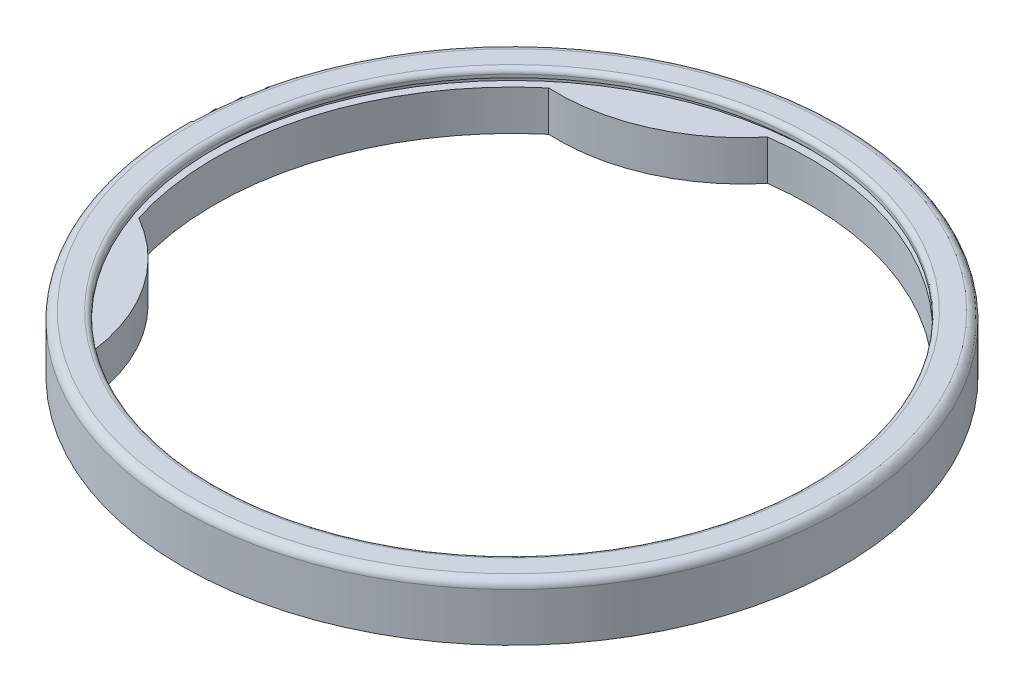
ISO-10303-21;
HEADER;
FILE_DESCRIPTION(('STEP AP214'),'2;1');
FILE_NAME('part.step','',(''),(''),'','','');
FILE_SCHEMA(('AUTOMOTIVE_DESIGN { 1 0 10303 214 1 1 1 1 }'));
ENDSEC;
DATA;
#1=APPLICATION_CONTEXT('core data for automotive mechanical design processes');
#2=APPLICATION_PROTOCOL_DEFINITION('international standard','automotive_design',2000,#1);
#3=PRODUCT_CONTEXT('',#1,'mechanical');
#4=PRODUCT('Part','Part','',(#3));
#5=PRODUCT_RELATED_PRODUCT_CATEGORY('part','',(#4));
#6=PRODUCT_DEFINITION_FORMATION('','',#4);
#7=PRODUCT_DEFINITION_CONTEXT('part definition',#1,'design');
#8=PRODUCT_DEFINITION('design','',#6,#7);
#9=PRODUCT_DEFINITION_SHAPE('','',#8);
#10=(LENGTH_UNIT() NAMED_UNIT(*) SI_UNIT(.MILLI.,.METRE.));
#11=(NAMED_UNIT(*) PLANE_ANGLE_UNIT() SI_UNIT($,.RADIAN.));
#12=(NAMED_UNIT(*) SI_UNIT($,.STERADIAN.) SOLID_ANGLE_UNIT());
#13=UNCERTAINTY_MEASURE_WITH_UNIT(LENGTH_MEASURE(1.E-05),#10,'distance_accuracy_value','');
#14=(GEOMETRIC_REPRESENTATION_CONTEXT(3) GLOBAL_UNCERTAINTY_ASSIGNED_CONTEXT((#13)) GLOBAL_UNIT_ASSIGNED_CONTEXT((#10,
#11,#12)) REPRESENTATION_CONTEXT('',''));
#15=CARTESIAN_POINT('',(0.,0.,0.));
#16=DIRECTION('',(0.,0.,1.));
#17=DIRECTION('',(1.,0.,0.));
#18=AXIS2_PLACEMENT_3D('',#15,#16,#17);
#19=CARTESIAN_POINT('',(0.,-25.,185.));
#20=DIRECTION('',(0.,1.,0.));
#21=DIRECTION('',(0.,0.,1.));
#22=AXIS2_PLACEMENT_3D('',#19,#20,#21);
#23=PLANE('',#22);
#24=CARTESIAN_POINT('',(0.,-25.,0.));
#25=DIRECTION('',(0.,-1.,0.));
#26=DIRECTION('',(0.,0.,-1.));
#27=AXIS2_PLACEMENT_3D('',#24,#25,#26);
#28=CIRCLE('',#27,205.);
#29=CARTESIAN_POINT('',(0.,-25.,-205.));
#30=VERTEX_POINT('',#29);
#31=EDGE_CURVE('E108',#30,#30,#28,.T.);
#32=ORIENTED_EDGE('',*,*,#31,.T.);
#33=EDGE_LOOP('',(#32));
#34=FACE_BOUND('',#33,.T.);
#35=CARTESIAN_POINT('',(0.,-25.,0.));
#36=DIRECTION('',(0.,-1.,0.));
#37=DIRECTION('',(0.,0.,-1.));
#38=AXIS2_PLACEMENT_3D('',#35,#36,#37);
#39=CIRCLE('',#38,185.);
#40=CARTESIAN_POINT('',(-24.3750303730397,-25.,-183.3871802889));
#41=VERTEX_POINT('',#40);
#42=CARTESIAN_POINT('',(-118.944143978469,-25.,141.694356321024));
#43=VERTEX_POINT('',#42);
#44=EDGE_CURVE('E89',#41,#43,#39,.T.);
#45=ORIENTED_EDGE('',*,*,#44,.F.);
#46=CARTESIAN_POINT('',(-113.063716434223,-25.,-256.594536235832));
#47=DIRECTION('',(0.,1.,0.));
#48=DIRECTION('',(0.,0.,1.));
#49=AXIS2_PLACEMENT_3D('',#46,#47,#48);
#50=CIRCLE('',#49,115.);
#51=CARTESIAN_POINT('',(-118.887266817006,-25.,-141.74208192623));
#52=VERTEX_POINT('',#51);
#53=EDGE_CURVE('E98',#52,#41,#50,.T.);
#54=ORIENTED_EDGE('',*,*,#53,.F.);
#55=CARTESIAN_POINT('',(-176.368437346702,-25.,55.8495685559199));
#56=VERTEX_POINT('',#55);
#57=EDGE_CURVE('E111',#56,#52,#39,.T.);
#58=ORIENTED_EDGE('',*,*,#57,.F.);
#59=CARTESIAN_POINT('',(-233.062980346567,-25.,155.903198145438));
#60=DIRECTION('',(0.,1.,0.));
#61=DIRECTION('',(0.,0.,1.));
#62=AXIS2_PLACEMENT_3D('',#59,#60,#61);
#63=CIRCLE('',#62,115.);
#64=EDGE_CURVE('E212',#56,#43,#63,.F.);
#65=ORIENTED_EDGE('',*,*,#64,.T.);
#66=EDGE_LOOP('',(#45,#54,#58,#65));
#67=FACE_BOUND('',#66,.T.);
#68=CARTESIAN_POINT('',(-153.768371484005,-25.,102.860526593816));
#69=DIRECTION('',(0.,-1.,0.));
#70=DIRECTION('',(0.,0.,-1.));
#71=AXIS2_PLACEMENT_3D('',#68,#69,#70);
#72=CIRCLE('',#71,9.99999999999999);
#73=CARTESIAN_POINT('',(-153.768371484005,-25.,92.860526593816));
#74=VERTEX_POINT('',#73);
#75=EDGE_CURVE('E207',#74,#74,#72,.T.);
#76=ORIENTED_EDGE('',*,*,#75,.F.);
#77=EDGE_LOOP('',(#76));
#78=FACE_BOUND('',#77,.T.);
#79=CARTESIAN_POINT('',(-74.5962465775012,-25.,-169.293827402385));
#80=DIRECTION('',(0.,1.,0.));
#81=DIRECTION('',(0.,0.,1.));
#82=AXIS2_PLACEMENT_3D('',#79,#80,#81);
#83=CIRCLE('',#82,10.);
#84=CARTESIAN_POINT('',(-74.5962465775012,-25.,-159.293827402385));
#85=VERTEX_POINT('',#84);
#86=EDGE_CURVE('E81',#85,#85,#83,.T.);
#87=ORIENTED_EDGE('',*,*,#86,.T.);
#88=EDGE_LOOP('',(#87));
#89=FACE_BOUND('',#88,.T.);
#90=ADVANCED_FACE('F35',(#34,#67,#78,#89),#23,.F.);
#91=CARTESIAN_POINT('',(0.,0.,0.));
#92=DIRECTION('',(0.,-1.,0.));
#93=DIRECTION('',(0.,0.,-1.));
#94=AXIS2_PLACEMENT_3D('',#91,#92,#93);
#95=CYLINDRICAL_SURFACE('',#94,185.);
#96=CARTESIAN_POINT('',(0.,0.,0.));
#97=DIRECTION('',(0.,-1.,0.));
#98=DIRECTION('',(0.,0.,-1.));
#99=AXIS2_PLACEMENT_3D('',#96,#97,#98);
#100=CIRCLE('',#99,185.);
#101=CARTESIAN_POINT('',(-176.368437346702,0.,55.8495685559199));
#102=VERTEX_POINT('',#101);
#103=CARTESIAN_POINT('',(-118.887266817006,0.,-141.74208192623));
#104=VERTEX_POINT('',#103);
#105=EDGE_CURVE('E93',#102,#104,#100,.T.);
#106=ORIENTED_EDGE('',*,*,#105,.F.);
#107=DIRECTION('',(0.,1.,0.));
#108=VECTOR('',#107,1.);
#109=CARTESIAN_POINT('',(-176.368437346702,-128.340156447465,55.8495685559199));
#110=LINE('',#109,#108);
#111=EDGE_CURVE('E79',#56,#102,#110,.T.);
#112=ORIENTED_EDGE('',*,*,#111,.F.);
#113=ORIENTED_EDGE('',*,*,#57,.T.);
#114=DIRECTION('',(0.,1.,0.));
#115=VECTOR('',#114,1.);
#116=CARTESIAN_POINT('',(-118.887266817006,-128.340156447465,-141.74208192623));
#117=LINE('',#116,#115);
#118=EDGE_CURVE('E216',#52,#104,#117,.T.);
#119=ORIENTED_EDGE('',*,*,#118,.T.);
#120=EDGE_LOOP('',(#106,#112,#113,#119));
#121=FACE_BOUND('',#120,.T.);
#122=ADVANCED_FACE('F137',(#121),#95,.F.);
#123=ORIENTED_EDGE('',*,*,#44,.T.);
#124=DIRECTION('',(0.,1.,0.));
#125=VECTOR('',#124,1.);
#126=CARTESIAN_POINT('',(-118.944143978469,-128.340156447465,141.694356321024));
#127=LINE('',#126,#125);
#128=CARTESIAN_POINT('',(-118.944143978469,0.,141.694356321024));
#129=VERTEX_POINT('',#128);
#130=EDGE_CURVE('E76',#43,#129,#127,.T.);
#131=ORIENTED_EDGE('',*,*,#130,.T.);
#132=CARTESIAN_POINT('',(-24.3750303730397,0.,-183.3871802889));
#133=VERTEX_POINT('',#132);
#134=EDGE_CURVE('E87',#133,#129,#100,.T.);
#135=ORIENTED_EDGE('',*,*,#134,.F.);
#136=DIRECTION('',(0.,1.,0.));
#137=VECTOR('',#136,1.);
#138=CARTESIAN_POINT('',(-24.3750303730397,-128.340156447465,-183.3871802889));
#139=LINE('',#138,#137);
#140=EDGE_CURVE('E100',#41,#133,#139,.T.);
#141=ORIENTED_EDGE('',*,*,#140,.F.);
#142=EDGE_LOOP('',(#123,#131,#135,#141));
#143=FACE_BOUND('',#142,.T.);
#144=ADVANCED_FACE('F85',(#143),#95,.F.);
#145=CARTESIAN_POINT('',(0.,0.,0.));
#146=DIRECTION('',(0.,-1.,0.));
#147=DIRECTION('',(0.,0.,-1.));
#148=AXIS2_PLACEMENT_3D('',#145,#146,#147);
#149=CYLINDRICAL_SURFACE('',#148,205.);
#150=CARTESIAN_POINT('',(0.,5.,0.));
#151=DIRECTION('',(0.,-1.,0.));
#152=DIRECTION('',(0.,0.,-1.));
#153=AXIS2_PLACEMENT_3D('',#150,#151,#152);
#154=CIRCLE('',#153,205.);
#155=CARTESIAN_POINT('',(0.,5.,-205.));
#156=VERTEX_POINT('',#155);
#157=EDGE_CURVE('E113',#156,#156,#154,.T.);
#158=ORIENTED_EDGE('',*,*,#157,.T.);
#159=EDGE_LOOP('',(#158));
#160=FACE_BOUND('',#159,.T.);
#161=ORIENTED_EDGE('',*,*,#31,.F.);
#162=EDGE_LOOP('',(#161));
#163=FACE_BOUND('',#162,.T.);
#164=ADVANCED_FACE('F147',(#160,#163),#149,.T.);
#165=CARTESIAN_POINT('',(0.,10.,185.));
#166=DIRECTION('',(0.,-1.,0.));
#167=DIRECTION('',(0.,0.,-1.));
#168=AXIS2_PLACEMENT_3D('',#165,#166,#167);
#169=PLANE('',#168);
#170=CARTESIAN_POINT('',(0.,10.,0.));
#171=DIRECTION('',(0.,-1.,0.));
#172=DIRECTION('',(0.,0.,-1.));
#173=AXIS2_PLACEMENT_3D('',#170,#171,#172);
#174=CIRCLE('',#173,188.);
#175=CARTESIAN_POINT('',(0.,10.,-188.));
#176=VERTEX_POINT('',#175);
#177=EDGE_CURVE('E43',#176,#176,#174,.T.);
#178=ORIENTED_EDGE('',*,*,#177,.T.);
#179=EDGE_LOOP('',(#178));
#180=FACE_BOUND('',#179,.T.);
#181=CARTESIAN_POINT('',(0.,10.,0.));
#182=DIRECTION('',(0.,-1.,0.));
#183=DIRECTION('',(0.,0.,-1.));
#184=AXIS2_PLACEMENT_3D('',#181,#182,#183);
#185=CIRCLE('',#184,200.);
#186=CARTESIAN_POINT('',(0.,10.,-200.));
#187=VERTEX_POINT('',#186);
#188=EDGE_CURVE('E116',#187,#187,#185,.F.);
#189=ORIENTED_EDGE('',*,*,#188,.T.);
#190=EDGE_LOOP('',(#189));
#191=FACE_BOUND('',#190,.T.);
#192=ADVANCED_FACE('F121',(#180,#191),#169,.F.);
#193=CARTESIAN_POINT('',(0.,0.,0.));
#194=DIRECTION('',(0.,-1.,0.));
#195=DIRECTION('',(0.,0.,-1.));
#196=AXIS2_PLACEMENT_3D('',#193,#194,#195);
#197=CYLINDRICAL_SURFACE('',#196,185.);
#198=CARTESIAN_POINT('',(0.,7.,0.));
#199=DIRECTION('',(0.,-1.,0.));
#200=DIRECTION('',(0.,0.,-1.));
#201=AXIS2_PLACEMENT_3D('',#198,#199,#200);
#202=CIRCLE('',#201,185.);
#203=CARTESIAN_POINT('',(0.,7.,-185.));
#204=VERTEX_POINT('',#203);
#205=EDGE_CURVE('E11',#204,#204,#202,.F.);
#206=ORIENTED_EDGE('',*,*,#205,.T.);
#207=EDGE_LOOP('',(#206));
#208=FACE_BOUND('',#207,.T.);
#209=CARTESIAN_POINT('',(0.,5.,0.));
#210=DIRECTION('',(0.,-1.,0.));
#211=DIRECTION('',(0.,0.,-1.));
#212=AXIS2_PLACEMENT_3D('',#209,#210,#211);
#213=CIRCLE('',#212,185.);
#214=CARTESIAN_POINT('',(0.,5.,-185.));
#215=VERTEX_POINT('',#214);
#216=EDGE_CURVE('E105',#215,#215,#213,.T.);
#217=ORIENTED_EDGE('',*,*,#216,.T.);
#218=EDGE_LOOP('',(#217));
#219=FACE_BOUND('',#218,.T.);
#220=ADVANCED_FACE('F157',(#208,#219),#197,.F.);
#221=CARTESIAN_POINT('',(0.,5.,185.));
#222=DIRECTION('',(0.,1.,0.));
#223=DIRECTION('',(0.,0.,1.));
#224=AXIS2_PLACEMENT_3D('',#221,#222,#223);
#225=PLANE('',#224);
#226=ORIENTED_EDGE('',*,*,#216,.F.);
#227=EDGE_LOOP('',(#226));
#228=FACE_BOUND('',#227,.T.);
#229=CARTESIAN_POINT('',(0.,5.,0.));
#230=DIRECTION('',(0.,-1.,0.));
#231=DIRECTION('',(0.,0.,-1.));
#232=AXIS2_PLACEMENT_3D('',#229,#230,#231);
#233=CIRCLE('',#232,190.);
#234=CARTESIAN_POINT('',(0.,5.,-190.));
#235=VERTEX_POINT('',#234);
#236=EDGE_CURVE('E96',#235,#235,#233,.T.);
#237=ORIENTED_EDGE('',*,*,#236,.T.);
#238=EDGE_LOOP('',(#237));
#239=FACE_BOUND('',#238,.T.);
#240=ADVANCED_FACE('F165',(#228,#239),#225,.F.);
#241=CARTESIAN_POINT('',(0.,0.,0.));
#242=DIRECTION('',(0.,-1.,0.));
#243=DIRECTION('',(0.,0.,-1.));
#244=AXIS2_PLACEMENT_3D('',#241,#242,#243);
#245=CYLINDRICAL_SURFACE('',#244,190.);
#246=ORIENTED_EDGE('',*,*,#236,.F.);
#247=EDGE_LOOP('',(#246));
#248=FACE_BOUND('',#247,.T.);
#249=CARTESIAN_POINT('',(0.,0.,0.));
#250=DIRECTION('',(0.,-1.,0.));
#251=DIRECTION('',(0.,0.,-1.));
#252=AXIS2_PLACEMENT_3D('',#249,#250,#251);
#253=CIRCLE('',#252,190.);
#254=CARTESIAN_POINT('',(0.,0.,-190.));
#255=VERTEX_POINT('',#254);
#256=EDGE_CURVE('E92',#255,#255,#253,.T.);
#257=ORIENTED_EDGE('',*,*,#256,.T.);
#258=EDGE_LOOP('',(#257));
#259=FACE_BOUND('',#258,.T.);
#260=ADVANCED_FACE('F171',(#248,#259),#245,.F.);
#261=CARTESIAN_POINT('',(0.,0.,190.));
#262=DIRECTION('',(0.,-1.,0.));
#263=DIRECTION('',(0.,0.,-1.));
#264=AXIS2_PLACEMENT_3D('',#261,#262,#263);
#265=PLANE('',#264);
#266=ORIENTED_EDGE('',*,*,#256,.F.);
#267=EDGE_LOOP('',(#266));
#268=FACE_BOUND('',#267,.T.);
#269=ORIENTED_EDGE('',*,*,#134,.T.);
#270=CARTESIAN_POINT('',(-233.062980346567,0.,155.903198145438));
#271=DIRECTION('',(0.,1.,0.));
#272=DIRECTION('',(0.,0.,1.));
#273=AXIS2_PLACEMENT_3D('',#270,#271,#272);
#274=CIRCLE('',#273,115.);
#275=EDGE_CURVE('E50',#129,#102,#274,.T.);
#276=ORIENTED_EDGE('',*,*,#275,.T.);
#277=ORIENTED_EDGE('',*,*,#105,.T.);
#278=CARTESIAN_POINT('',(-113.063716434223,0.,-256.594536235832));
#279=DIRECTION('',(0.,1.,0.));
#280=DIRECTION('',(0.,0.,1.));
#281=AXIS2_PLACEMENT_3D('',#278,#279,#280);
#282=CIRCLE('',#281,115.);
#283=EDGE_CURVE('E55',#133,#104,#282,.F.);
#284=ORIENTED_EDGE('',*,*,#283,.F.);
#285=EDGE_LOOP('',(#269,#276,#277,#284));
#286=FACE_BOUND('',#285,.T.);
#287=ADVANCED_FACE('F91',(#268,#286),#265,.F.);
#288=CARTESIAN_POINT('',(0.,5.,0.));
#289=DIRECTION('',(0.,-1.,0.));
#290=DIRECTION('',(0.,0.,-1.));
#291=AXIS2_PLACEMENT_3D('',#288,#289,#290);
#292=TOROIDAL_SURFACE('',#291,200.,5.);
#293=ORIENTED_EDGE('',*,*,#188,.F.);
#294=EDGE_LOOP('',(#293));
#295=FACE_BOUND('',#294,.T.);
#296=ORIENTED_EDGE('',*,*,#157,.F.);
#297=EDGE_LOOP('',(#296));
#298=FACE_BOUND('',#297,.T.);
#299=ADVANCED_FACE('F126',(#295,#298),#292,.T.);
#300=CARTESIAN_POINT('',(0.,7.,0.));
#301=DIRECTION('',(0.,-1.,0.));
#302=DIRECTION('',(0.,0.,-1.));
#303=AXIS2_PLACEMENT_3D('',#300,#301,#302);
#304=TOROIDAL_SURFACE('',#303,188.,3.);
#305=ORIENTED_EDGE('',*,*,#205,.F.);
#306=EDGE_LOOP('',(#305));
#307=FACE_BOUND('',#306,.T.);
#308=ORIENTED_EDGE('',*,*,#177,.F.);
#309=EDGE_LOOP('',(#308));
#310=FACE_BOUND('',#309,.T.);
#311=ADVANCED_FACE('F37',(#307,#310),#304,.T.);
#312=CARTESIAN_POINT('',(-113.063716434223,-128.340156447465,-256.594536235832));
#313=DIRECTION('',(0.,1.,0.));
#314=DIRECTION('',(0.,0.,1.));
#315=AXIS2_PLACEMENT_3D('',#312,#313,#314);
#316=CYLINDRICAL_SURFACE('',#315,115.);
#317=ORIENTED_EDGE('',*,*,#118,.F.);
#318=ORIENTED_EDGE('',*,*,#53,.T.);
#319=ORIENTED_EDGE('',*,*,#140,.T.);
#320=ORIENTED_EDGE('',*,*,#283,.T.);
#321=EDGE_LOOP('',(#317,#318,#319,#320));
#322=FACE_BOUND('',#321,.T.);
#323=ADVANCED_FACE('F125',(#322),#316,.T.);
#324=CARTESIAN_POINT('',(-233.062980346567,-128.340156447465,155.903198145438));
#325=DIRECTION('',(0.,1.,0.));
#326=DIRECTION('',(0.,0.,1.));
#327=AXIS2_PLACEMENT_3D('',#324,#325,#326);
#328=CYLINDRICAL_SURFACE('',#327,115.);
#329=ORIENTED_EDGE('',*,*,#64,.F.);
#330=ORIENTED_EDGE('',*,*,#111,.T.);
#331=ORIENTED_EDGE('',*,*,#275,.F.);
#332=ORIENTED_EDGE('',*,*,#130,.F.);
#333=EDGE_LOOP('',(#329,#330,#331,#332));
#334=FACE_BOUND('',#333,.T.);
#335=ADVANCED_FACE('F75',(#334),#328,.T.);
#336=CARTESIAN_POINT('',(-153.768371484005,-25.,102.860526593816));
#337=DIRECTION('',(0.,1.,0.));
#338=DIRECTION('',(0.,0.,1.));
#339=AXIS2_PLACEMENT_3D('',#336,#337,#338);
#340=CYLINDRICAL_SURFACE('',#339,9.99999999999999);
#341=ORIENTED_EDGE('',*,*,#75,.T.);
#342=EDGE_LOOP('',(#341));
#343=FACE_BOUND('',#342,.T.);
#344=CARTESIAN_POINT('',(-153.768371484005,-5.,102.860526593816));
#345=DIRECTION('',(0.,-1.,0.));
#346=DIRECTION('',(0.,0.,-1.));
#347=AXIS2_PLACEMENT_3D('',#344,#345,#346);
#348=CIRCLE('',#347,9.99999999999999);
#349=CARTESIAN_POINT('',(-153.768371484005,-5.,92.860526593816));
#350=VERTEX_POINT('',#349);
#351=EDGE_CURVE('E202',#350,#350,#348,.T.);
#352=ORIENTED_EDGE('',*,*,#351,.F.);
#353=EDGE_LOOP('',(#352));
#354=FACE_BOUND('',#353,.T.);
#355=ADVANCED_FACE('F181',(#343,#354),#340,.F.);
#356=CARTESIAN_POINT('',(-153.768371484005,-5.,102.860526593816));
#357=DIRECTION('',(0.,-1.,0.));
#358=DIRECTION('',(0.,0.,-1.));
#359=AXIS2_PLACEMENT_3D('',#356,#357,#358);
#360=PLANE('',#359);
#361=ORIENTED_EDGE('',*,*,#351,.T.);
#362=EDGE_LOOP('',(#361));
#363=FACE_BOUND('',#362,.T.);
#364=ADVANCED_FACE('F182',(#363),#360,.T.);
#365=CARTESIAN_POINT('',(-74.5962465775012,-25.,-169.293827402385));
#366=DIRECTION('',(0.,1.,0.));
#367=DIRECTION('',(0.,0.,1.));
#368=AXIS2_PLACEMENT_3D('',#365,#366,#367);
#369=CYLINDRICAL_SURFACE('',#368,10.);
#370=ORIENTED_EDGE('',*,*,#86,.F.);
#371=EDGE_LOOP('',(#370));
#372=FACE_BOUND('',#371,.T.);
#373=CARTESIAN_POINT('',(-74.5962465775012,-5.,-169.293827402385));
#374=DIRECTION('',(0.,1.,0.));
#375=DIRECTION('',(0.,0.,1.));
#376=AXIS2_PLACEMENT_3D('',#373,#374,#375);
#377=CIRCLE('',#376,10.);
#378=CARTESIAN_POINT('',(-74.5962465775012,-5.,-159.293827402385));
#379=VERTEX_POINT('',#378);
#380=EDGE_CURVE('E200',#379,#379,#377,.T.);
#381=ORIENTED_EDGE('',*,*,#380,.T.);
#382=EDGE_LOOP('',(#381));
#383=FACE_BOUND('',#382,.T.);
#384=ADVANCED_FACE('F185',(#372,#383),#369,.F.);
#385=CARTESIAN_POINT('',(-74.5962465775012,-5.,-169.293827402385));
#386=DIRECTION('',(0.,1.,0.));
#387=DIRECTION('',(0.,0.,1.));
#388=AXIS2_PLACEMENT_3D('',#385,#386,#387);
#389=PLANE('',#388);
#390=ORIENTED_EDGE('',*,*,#380,.F.);
#391=EDGE_LOOP('',(#390));
#392=FACE_BOUND('',#391,.T.);
#393=ADVANCED_FACE('F192',(#392),#389,.F.);
#394=CLOSED_SHELL('',(#90,#122,#144,#164,#192,#220,#240,#260,#287,#299,#311,#323,#335,#355,#364,
#384,#393));
#395=MANIFOLD_SOLID_BREP('B2',#394);
#396=ADVANCED_BREP_SHAPE_REPRESENTATION('',(#18,#395),#14);
#397=SHAPE_DEFINITION_REPRESENTATION(#9,#396);
ENDSEC;
END-ISO-10303-21;
